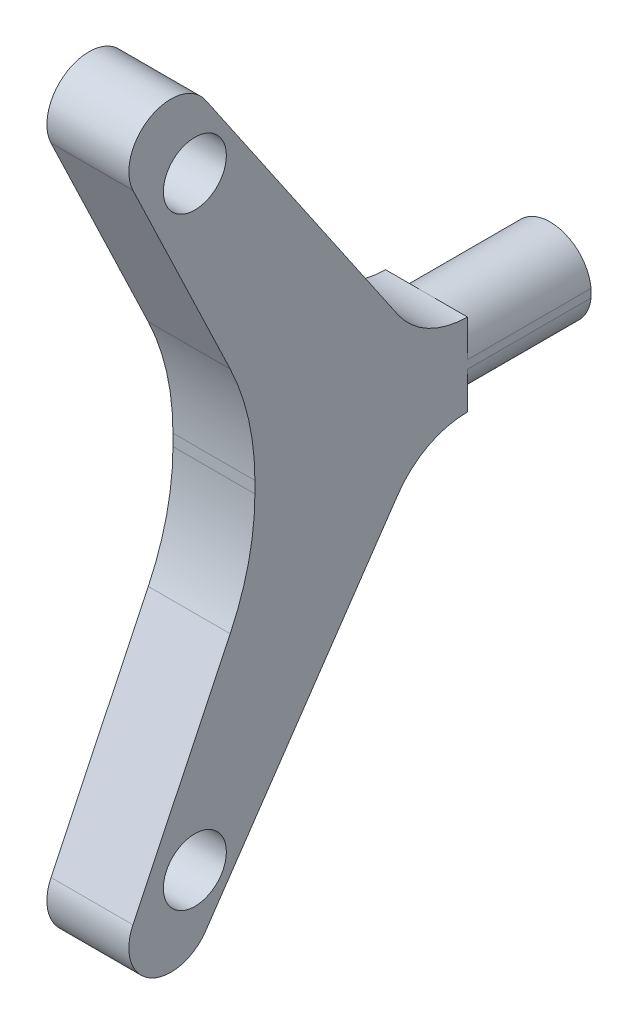
ISO-10303-21;
HEADER;
FILE_DESCRIPTION(('STEP AP214'),'2;1');
FILE_NAME('part.step','',(''),(''),'','','');
FILE_SCHEMA(('AUTOMOTIVE_DESIGN { 1 0 10303 214 1 1 1 1 }'));
ENDSEC;
DATA;
#1=APPLICATION_CONTEXT('core data for automotive mechanical design processes');
#2=APPLICATION_PROTOCOL_DEFINITION('international standard','automotive_design',2000,#1);
#3=PRODUCT_CONTEXT('',#1,'mechanical');
#4=PRODUCT('Part','Part','',(#3));
#5=PRODUCT_RELATED_PRODUCT_CATEGORY('part','',(#4));
#6=PRODUCT_DEFINITION_FORMATION('','',#4);
#7=PRODUCT_DEFINITION_CONTEXT('part definition',#1,'design');
#8=PRODUCT_DEFINITION('design','',#6,#7);
#9=PRODUCT_DEFINITION_SHAPE('','',#8);
#10=(LENGTH_UNIT() NAMED_UNIT(*) SI_UNIT(.MILLI.,.METRE.));
#11=(NAMED_UNIT(*) PLANE_ANGLE_UNIT() SI_UNIT($,.RADIAN.));
#12=(NAMED_UNIT(*) SI_UNIT($,.STERADIAN.) SOLID_ANGLE_UNIT());
#13=UNCERTAINTY_MEASURE_WITH_UNIT(LENGTH_MEASURE(1.E-05),#10,'distance_accuracy_value','');
#14=(GEOMETRIC_REPRESENTATION_CONTEXT(3) GLOBAL_UNCERTAINTY_ASSIGNED_CONTEXT((#13)) GLOBAL_UNIT_ASSIGNED_CONTEXT((#10,
#11,#12)) REPRESENTATION_CONTEXT('',''));
#15=CARTESIAN_POINT('',(0.,0.,0.));
#16=DIRECTION('',(0.,0.,1.));
#17=DIRECTION('',(1.,0.,0.));
#18=AXIS2_PLACEMENT_3D('',#15,#16,#17);
#19=CARTESIAN_POINT('',(4.875,4.9,-40.));
#20=DIRECTION('',(0.,0.,1.));
#21=DIRECTION('',(1.,0.,0.));
#22=AXIS2_PLACEMENT_3D('',#19,#20,#21);
#23=PLANE('',#22);
#24=CARTESIAN_POINT('',(0.,0.,-40.));
#25=DIRECTION('',(0.,0.,-1.));
#26=DIRECTION('',(-1.,0.,0.));
#27=AXIS2_PLACEMENT_3D('',#24,#25,#26);
#28=CIRCLE('',#27,4.9);
#29=CARTESIAN_POINT('',(-4.875,0.494342998332145,-40.));
#30=VERTEX_POINT('',#29);
#31=CARTESIAN_POINT('',(4.875,0.494342998332146,-40.));
#32=VERTEX_POINT('',#31);
#33=EDGE_CURVE('E64',#30,#32,#28,.T.);
#34=ORIENTED_EDGE('',*,*,#33,.T.);
#35=DIRECTION('',(0.,1.,0.));
#36=VECTOR('',#35,1.);
#37=CARTESIAN_POINT('',(4.875,4.9,-40.));
#38=LINE('',#37,#36);
#39=CARTESIAN_POINT('',(4.875,-0.494342998332146,-40.));
#40=VERTEX_POINT('',#39);
#41=EDGE_CURVE('E296',#40,#32,#38,.T.);
#42=ORIENTED_EDGE('',*,*,#41,.F.);
#43=CARTESIAN_POINT('',(-4.875,-0.494342998332146,-40.));
#44=VERTEX_POINT('',#43);
#45=EDGE_CURVE('E341',#40,#44,#28,.T.);
#46=ORIENTED_EDGE('',*,*,#45,.T.);
#47=DIRECTION('',(0.,1.,0.));
#48=VECTOR('',#47,1.);
#49=CARTESIAN_POINT('',(-4.875,4.9,-40.));
#50=LINE('',#49,#48);
#51=EDGE_CURVE('E188',#44,#30,#50,.T.);
#52=ORIENTED_EDGE('',*,*,#51,.T.);
#53=EDGE_LOOP('',(#34,#42,#46,#52));
#54=FACE_BOUND('',#53,.T.);
#55=ADVANCED_FACE('F39',(#54),#23,.F.);
#56=CARTESIAN_POINT('',(4.875,40.,10.));
#57=DIRECTION('',(-1.,0.,0.));
#58=DIRECTION('',(0.,0.,1.));
#59=AXIS2_PLACEMENT_3D('',#56,#57,#58);
#60=PLANE('',#59);
#61=CARTESIAN_POINT('',(4.875,-35.8845811988186,7.14483633710532));
#62=DIRECTION('',(1.,0.,0.));
#63=DIRECTION('',(0.,0.,-1.));
#64=AXIS2_PLACEMENT_3D('',#61,#62,#63);
#65=CIRCLE('',#64,3.75);
#66=CARTESIAN_POINT('',(4.875,-35.8845811988186,3.39483633710531));
#67=VERTEX_POINT('',#66);
#68=EDGE_CURVE('E352',#67,#67,#65,.T.);
#69=ORIENTED_EDGE('',*,*,#68,.F.);
#70=EDGE_LOOP('',(#69));
#71=FACE_BOUND('',#70,.T.);
#72=CARTESIAN_POINT('',(4.875,35.8845811988187,7.14483633710531));
#73=DIRECTION('',(1.,0.,0.));
#74=DIRECTION('',(0.,0.,-1.));
#75=AXIS2_PLACEMENT_3D('',#72,#73,#74);
#76=CIRCLE('',#75,3.75);
#77=CARTESIAN_POINT('',(4.875,35.8845811988187,3.3948363371053));
#78=VERTEX_POINT('',#77);
#79=EDGE_CURVE('E343',#78,#78,#76,.T.);
#80=ORIENTED_EDGE('',*,*,#79,.F.);
#81=EDGE_LOOP('',(#80));
#82=FACE_BOUND('',#81,.T.);
#83=DIRECTION('',(0.,-1.,0.));
#84=VECTOR('',#83,1.);
#85=CARTESIAN_POINT('',(4.875,40.,-25.2831158131346));
#86=LINE('',#85,#84);
#87=CARTESIAN_POINT('',(4.875,4.9,-25.2831158131346));
#88=VERTEX_POINT('',#87);
#89=CARTESIAN_POINT('',(4.875,0.494342998332146,-25.2831158131346));
#90=VERTEX_POINT('',#89);
#91=EDGE_CURVE('E328',#88,#90,#86,.T.);
#92=ORIENTED_EDGE('',*,*,#91,.F.);
#93=CARTESIAN_POINT('',(4.875,14.9,-25.2831158131346));
#94=DIRECTION('',(-1.,0.,0.));
#95=DIRECTION('',(0.,0.,-1.));
#96=AXIS2_PLACEMENT_3D('',#93,#94,#95);
#97=CIRCLE('',#96,10.);
#98=CARTESIAN_POINT('',(4.875,9.2641664066958,-17.022523842302));
#99=VERTEX_POINT('',#98);
#100=EDGE_CURVE('E293',#88,#99,#97,.T.);
#101=ORIENTED_EDGE('',*,*,#100,.T.);
#102=DIRECTION('',(0.,0.826059197083259,0.563583359330421));
#103=VECTOR('',#102,1.);
#104=CARTESIAN_POINT('',(4.875,42.8179167966521,5.8697040145837));
#105=LINE('',#104,#103);
#106=CARTESIAN_POINT('',(4.875,42.8179167966521,5.8697040145837));
#107=VERTEX_POINT('',#106);
#108=EDGE_CURVE('E204',#99,#107,#105,.T.);
#109=ORIENTED_EDGE('',*,*,#108,.T.);
#110=CARTESIAN_POINT('',(4.875,40.,10.));
#111=DIRECTION('',(1.,0.,0.));
#112=DIRECTION('',(0.,0.,1.));
#113=AXIS2_PLACEMENT_3D('',#110,#111,#112);
#114=CIRCLE('',#113,5.);
#115=CARTESIAN_POINT('',(4.875,37.8428514543704,14.5107327732962));
#116=VERTEX_POINT('',#115);
#117=EDGE_CURVE('E193',#107,#116,#114,.T.);
#118=ORIENTED_EDGE('',*,*,#117,.T.);
#119=DIRECTION('',(0.,-0.902146554659234,-0.431429709125918));
#120=VECTOR('',#119,1.);
#121=CARTESIAN_POINT('',(4.875,13.638530567672,2.93560336022303));
#122=LINE('',#121,#120);
#123=CARTESIAN_POINT('',(4.875,13.638530567672,2.93560336022303));
#124=VERTEX_POINT('',#123);
#125=EDGE_CURVE('E322',#116,#124,#122,.T.);
#126=ORIENTED_EDGE('',*,*,#125,.T.);
#127=CARTESIAN_POINT('',(4.875,0.695639293894342,30.));
#128=DIRECTION('',(-1.,0.,0.));
#129=DIRECTION('',(0.,0.,-1.));
#130=AXIS2_PLACEMENT_3D('',#127,#128,#129);
#131=CIRCLE('',#130,30.);
#132=CARTESIAN_POINT('',(4.875,0.695639293894235,0.));
#133=VERTEX_POINT('',#132);
#134=EDGE_CURVE('E319',#124,#133,#131,.T.);
#135=ORIENTED_EDGE('',*,*,#134,.T.);
#136=DIRECTION('',(0.,-1.,0.));
#137=VECTOR('',#136,1.);
#138=CARTESIAN_POINT('',(4.875,-0.695639293894238,0.));
#139=LINE('',#138,#137);
#140=CARTESIAN_POINT('',(4.875,-0.695639293894238,0.));
#141=VERTEX_POINT('',#140);
#142=EDGE_CURVE('E316',#133,#141,#139,.T.);
#143=ORIENTED_EDGE('',*,*,#142,.T.);
#144=CARTESIAN_POINT('',(4.875,-0.695639293894342,30.));
#145=DIRECTION('',(-1.,0.,0.));
#146=DIRECTION('',(0.,0.,-1.));
#147=AXIS2_PLACEMENT_3D('',#144,#145,#146);
#148=CIRCLE('',#147,30.);
#149=CARTESIAN_POINT('',(4.875,-13.638530567672,2.93560336022304));
#150=VERTEX_POINT('',#149);
#151=EDGE_CURVE('E313',#141,#150,#148,.T.);
#152=ORIENTED_EDGE('',*,*,#151,.T.);
#153=DIRECTION('',(0.,-0.902146554659234,0.431429709125918));
#154=VECTOR('',#153,1.);
#155=CARTESIAN_POINT('',(4.875,-13.638530567672,2.93560336022303));
#156=LINE('',#155,#154);
#157=CARTESIAN_POINT('',(4.875,-37.8428514543704,14.5107327732962));
#158=VERTEX_POINT('',#157);
#159=EDGE_CURVE('E310',#150,#158,#156,.T.);
#160=ORIENTED_EDGE('',*,*,#159,.T.);
#161=CARTESIAN_POINT('',(4.875,-40.,10.));
#162=DIRECTION('',(1.,0.,0.));
#163=DIRECTION('',(0.,0.,-1.));
#164=AXIS2_PLACEMENT_3D('',#161,#162,#163);
#165=CIRCLE('',#164,5.);
#166=CARTESIAN_POINT('',(4.875,-42.8179167966521,5.86970401458371));
#167=VERTEX_POINT('',#166);
#168=EDGE_CURVE('E307',#158,#167,#165,.T.);
#169=ORIENTED_EDGE('',*,*,#168,.T.);
#170=DIRECTION('',(0.,0.826059197083259,-0.563583359330421));
#171=VECTOR('',#170,1.);
#172=CARTESIAN_POINT('',(4.875,-42.8179167966521,5.8697040145837));
#173=LINE('',#172,#171);
#174=CARTESIAN_POINT('',(4.875,-9.26416640669579,-17.022523842302));
#175=VERTEX_POINT('',#174);
#176=EDGE_CURVE('E304',#167,#175,#173,.T.);
#177=ORIENTED_EDGE('',*,*,#176,.T.);
#178=CARTESIAN_POINT('',(4.875,-14.9,-25.2831158131346));
#179=DIRECTION('',(-1.,0.,0.));
#180=DIRECTION('',(0.,0.,-1.));
#181=AXIS2_PLACEMENT_3D('',#178,#179,#180);
#182=CIRCLE('',#181,10.);
#183=CARTESIAN_POINT('',(4.875,-4.9,-25.2831158131346));
#184=VERTEX_POINT('',#183);
#185=EDGE_CURVE('E300',#175,#184,#182,.T.);
#186=ORIENTED_EDGE('',*,*,#185,.T.);
#187=CARTESIAN_POINT('',(4.875,-0.494342998332146,-25.2831158131346));
#188=VERTEX_POINT('',#187);
#189=EDGE_CURVE('E290',#188,#184,#86,.T.);
#190=ORIENTED_EDGE('',*,*,#189,.F.);
#191=DIRECTION('',(0.,0.,-1.));
#192=VECTOR('',#191,1.);
#193=CARTESIAN_POINT('',(4.875,-0.494342998332146,-25.2831158131346));
#194=LINE('',#193,#192);
#195=EDGE_CURVE('E175',#40,#188,#194,.F.);
#196=ORIENTED_EDGE('',*,*,#195,.F.);
#197=ORIENTED_EDGE('',*,*,#41,.T.);
#198=DIRECTION('',(0.,0.,-1.));
#199=VECTOR('',#198,1.);
#200=CARTESIAN_POINT('',(4.875,0.494342998332146,-25.2831158131346));
#201=LINE('',#200,#199);
#202=EDGE_CURVE('E335',#90,#32,#201,.T.);
#203=ORIENTED_EDGE('',*,*,#202,.F.);
#204=EDGE_LOOP('',(#92,#101,#109,#118,#126,#135,#143,#152,#160,#169,#177,#186,#190,#196,#197,#203));
#205=FACE_BOUND('',#204,.T.);
#206=ADVANCED_FACE('F370',(#71,#82,#205),#60,.F.);
#207=CARTESIAN_POINT('',(-4.875,40.,10.));
#208=DIRECTION('',(-1.,0.,0.));
#209=DIRECTION('',(0.,0.,1.));
#210=AXIS2_PLACEMENT_3D('',#207,#208,#209);
#211=PLANE('',#210);
#212=CARTESIAN_POINT('',(-4.875,-35.8845811988186,7.14483633710532));
#213=DIRECTION('',(1.,0.,0.));
#214=DIRECTION('',(0.,0.,-1.));
#215=AXIS2_PLACEMENT_3D('',#212,#213,#214);
#216=CIRCLE('',#215,3.75);
#217=CARTESIAN_POINT('',(-4.875,-35.8845811988186,3.39483633710531));
#218=VERTEX_POINT('',#217);
#219=EDGE_CURVE('E348',#218,#218,#216,.T.);
#220=ORIENTED_EDGE('',*,*,#219,.T.);
#221=EDGE_LOOP('',(#220));
#222=FACE_BOUND('',#221,.T.);
#223=CARTESIAN_POINT('',(-4.875,35.8845811988187,7.14483633710531));
#224=DIRECTION('',(1.,0.,0.));
#225=DIRECTION('',(0.,0.,-1.));
#226=AXIS2_PLACEMENT_3D('',#223,#224,#225);
#227=CIRCLE('',#226,3.75);
#228=CARTESIAN_POINT('',(-4.875,35.8845811988187,3.3948363371053));
#229=VERTEX_POINT('',#228);
#230=EDGE_CURVE('E347',#229,#229,#227,.T.);
#231=ORIENTED_EDGE('',*,*,#230,.T.);
#232=EDGE_LOOP('',(#231));
#233=FACE_BOUND('',#232,.T.);
#234=CARTESIAN_POINT('',(-4.875,14.9,-25.2831158131346));
#235=DIRECTION('',(-1.,0.,0.));
#236=DIRECTION('',(0.,0.,-1.));
#237=AXIS2_PLACEMENT_3D('',#234,#235,#236);
#238=CIRCLE('',#237,10.);
#239=CARTESIAN_POINT('',(-4.875,4.9,-25.2831158131346));
#240=VERTEX_POINT('',#239);
#241=CARTESIAN_POINT('',(-4.875,9.2641664066958,-17.022523842302));
#242=VERTEX_POINT('',#241);
#243=EDGE_CURVE('E181',#240,#242,#238,.T.);
#244=ORIENTED_EDGE('',*,*,#243,.F.);
#245=DIRECTION('',(0.,-1.,0.));
#246=VECTOR('',#245,1.);
#247=CARTESIAN_POINT('',(-4.875,40.,-25.2831158131346));
#248=LINE('',#247,#246);
#249=CARTESIAN_POINT('',(-4.875,0.494342998332146,-25.2831158131346));
#250=VERTEX_POINT('',#249);
#251=EDGE_CURVE('E12',#240,#250,#248,.T.);
#252=ORIENTED_EDGE('',*,*,#251,.T.);
#253=DIRECTION('',(0.,0.,-1.));
#254=VECTOR('',#253,1.);
#255=CARTESIAN_POINT('',(-4.875,0.494342998332146,-25.2831158131346));
#256=LINE('',#255,#254);
#257=EDGE_CURVE('E43',#250,#30,#256,.T.);
#258=ORIENTED_EDGE('',*,*,#257,.T.);
#259=ORIENTED_EDGE('',*,*,#51,.F.);
#260=DIRECTION('',(0.,0.,-1.));
#261=VECTOR('',#260,1.);
#262=CARTESIAN_POINT('',(-4.875,-0.494342998332146,-25.2831158131346));
#263=LINE('',#262,#261);
#264=CARTESIAN_POINT('',(-4.875,-0.494342998332146,-25.2831158131346));
#265=VERTEX_POINT('',#264);
#266=EDGE_CURVE('E245',#44,#265,#263,.F.);
#267=ORIENTED_EDGE('',*,*,#266,.T.);
#268=CARTESIAN_POINT('',(-4.875,-4.9,-25.2831158131346));
#269=VERTEX_POINT('',#268);
#270=EDGE_CURVE('E49',#265,#269,#248,.T.);
#271=ORIENTED_EDGE('',*,*,#270,.T.);
#272=CARTESIAN_POINT('',(-4.875,-14.9,-25.2831158131346));
#273=DIRECTION('',(-1.,0.,0.));
#274=DIRECTION('',(0.,0.,-1.));
#275=AXIS2_PLACEMENT_3D('',#272,#273,#274);
#276=CIRCLE('',#275,10.);
#277=CARTESIAN_POINT('',(-4.875,-9.26416640669579,-17.022523842302));
#278=VERTEX_POINT('',#277);
#279=EDGE_CURVE('E195',#278,#269,#276,.T.);
#280=ORIENTED_EDGE('',*,*,#279,.F.);
#281=DIRECTION('',(0.,0.826059197083259,-0.563583359330421));
#282=VECTOR('',#281,1.);
#283=CARTESIAN_POINT('',(-4.875,-42.8179167966521,5.8697040145837));
#284=LINE('',#283,#282);
#285=CARTESIAN_POINT('',(-4.875,-42.8179167966521,5.86970401458371));
#286=VERTEX_POINT('',#285);
#287=EDGE_CURVE('E263',#286,#278,#284,.T.);
#288=ORIENTED_EDGE('',*,*,#287,.F.);
#289=CARTESIAN_POINT('',(-4.875,-40.,10.));
#290=DIRECTION('',(1.,0.,0.));
#291=DIRECTION('',(0.,0.,-1.));
#292=AXIS2_PLACEMENT_3D('',#289,#290,#291);
#293=CIRCLE('',#292,5.);
#294=CARTESIAN_POINT('',(-4.875,-37.8428514543704,14.5107327732962));
#295=VERTEX_POINT('',#294);
#296=EDGE_CURVE('E266',#295,#286,#293,.T.);
#297=ORIENTED_EDGE('',*,*,#296,.F.);
#298=DIRECTION('',(0.,-0.902146554659234,0.431429709125918));
#299=VECTOR('',#298,1.);
#300=CARTESIAN_POINT('',(-4.875,-13.638530567672,2.93560336022303));
#301=LINE('',#300,#299);
#302=CARTESIAN_POINT('',(-4.875,-13.638530567672,2.93560336022304));
#303=VERTEX_POINT('',#302);
#304=EDGE_CURVE('E271',#303,#295,#301,.T.);
#305=ORIENTED_EDGE('',*,*,#304,.F.);
#306=CARTESIAN_POINT('',(-4.875,-0.695639293894342,30.));
#307=DIRECTION('',(-1.,0.,0.));
#308=DIRECTION('',(0.,0.,-1.));
#309=AXIS2_PLACEMENT_3D('',#306,#307,#308);
#310=CIRCLE('',#309,30.);
#311=CARTESIAN_POINT('',(-4.875,-0.695639293894238,0.));
#312=VERTEX_POINT('',#311);
#313=EDGE_CURVE('E274',#312,#303,#310,.T.);
#314=ORIENTED_EDGE('',*,*,#313,.F.);
#315=DIRECTION('',(0.,-1.,0.));
#316=VECTOR('',#315,1.);
#317=CARTESIAN_POINT('',(-4.875,-0.695639293894238,0.));
#318=LINE('',#317,#316);
#319=CARTESIAN_POINT('',(-4.875,0.695639293894235,0.));
#320=VERTEX_POINT('',#319);
#321=EDGE_CURVE('E277',#320,#312,#318,.T.);
#322=ORIENTED_EDGE('',*,*,#321,.F.);
#323=CARTESIAN_POINT('',(-4.875,0.695639293894342,30.));
#324=DIRECTION('',(-1.,0.,0.));
#325=DIRECTION('',(0.,0.,-1.));
#326=AXIS2_PLACEMENT_3D('',#323,#324,#325);
#327=CIRCLE('',#326,30.);
#328=CARTESIAN_POINT('',(-4.875,13.638530567672,2.93560336022303));
#329=VERTEX_POINT('',#328);
#330=EDGE_CURVE('E280',#329,#320,#327,.T.);
#331=ORIENTED_EDGE('',*,*,#330,.F.);
#332=DIRECTION('',(0.,-0.902146554659234,-0.431429709125918));
#333=VECTOR('',#332,1.);
#334=CARTESIAN_POINT('',(-4.875,13.638530567672,2.93560336022303));
#335=LINE('',#334,#333);
#336=CARTESIAN_POINT('',(-4.875,37.8428514543704,14.5107327732962));
#337=VERTEX_POINT('',#336);
#338=EDGE_CURVE('E283',#337,#329,#335,.T.);
#339=ORIENTED_EDGE('',*,*,#338,.F.);
#340=CARTESIAN_POINT('',(-4.875,40.,10.));
#341=DIRECTION('',(1.,0.,0.));
#342=DIRECTION('',(0.,0.,1.));
#343=AXIS2_PLACEMENT_3D('',#340,#341,#342);
#344=CIRCLE('',#343,5.);
#345=CARTESIAN_POINT('',(-4.875,42.8179167966521,5.8697040145837));
#346=VERTEX_POINT('',#345);
#347=EDGE_CURVE('E286',#346,#337,#344,.T.);
#348=ORIENTED_EDGE('',*,*,#347,.F.);
#349=DIRECTION('',(0.,0.826059197083259,0.563583359330421));
#350=VECTOR('',#349,1.);
#351=CARTESIAN_POINT('',(-4.875,42.8179167966521,5.8697040145837));
#352=LINE('',#351,#350);
#353=EDGE_CURVE('E183',#242,#346,#352,.T.);
#354=ORIENTED_EDGE('',*,*,#353,.F.);
#355=EDGE_LOOP('',(#244,#252,#258,#259,#267,#271,#280,#288,#297,#305,#314,#322,#331,#339,#348,#354));
#356=FACE_BOUND('',#355,.T.);
#357=ADVANCED_FACE('F179',(#222,#233,#356),#211,.T.);
#358=CARTESIAN_POINT('',(4.875,40.,10.));
#359=DIRECTION('',(-1.,0.,0.));
#360=DIRECTION('',(0.,0.,1.));
#361=AXIS2_PLACEMENT_3D('',#358,#359,#360);
#362=CYLINDRICAL_SURFACE('',#361,5.);
#363=ORIENTED_EDGE('',*,*,#347,.T.);
#364=DIRECTION('',(-1.,0.,0.));
#365=VECTOR('',#364,1.);
#366=CARTESIAN_POINT('',(4.875,37.8428514543704,14.5107327732962));
#367=LINE('',#366,#365);
#368=EDGE_CURVE('E241',#116,#337,#367,.T.);
#369=ORIENTED_EDGE('',*,*,#368,.F.);
#370=ORIENTED_EDGE('',*,*,#117,.F.);
#371=DIRECTION('',(-1.,0.,0.));
#372=VECTOR('',#371,1.);
#373=CARTESIAN_POINT('',(4.875,42.8179167966521,5.8697040145837));
#374=LINE('',#373,#372);
#375=EDGE_CURVE('E199',#107,#346,#374,.T.);
#376=ORIENTED_EDGE('',*,*,#375,.T.);
#377=EDGE_LOOP('',(#363,#369,#370,#376));
#378=FACE_BOUND('',#377,.T.);
#379=ADVANCED_FACE('F41',(#378),#362,.T.);
#380=CARTESIAN_POINT('',(4.875,13.638530567672,2.93560336022303));
#381=DIRECTION('',(0.,0.431429709125918,-0.902146554659234));
#382=DIRECTION('',(0.,0.902146554659234,0.431429709125918));
#383=AXIS2_PLACEMENT_3D('',#380,#381,#382);
#384=PLANE('',#383);
#385=ORIENTED_EDGE('',*,*,#338,.T.);
#386=DIRECTION('',(-1.,0.,0.));
#387=VECTOR('',#386,1.);
#388=CARTESIAN_POINT('',(4.875,13.638530567672,2.93560336022303));
#389=LINE('',#388,#387);
#390=EDGE_CURVE('E237',#124,#329,#389,.T.);
#391=ORIENTED_EDGE('',*,*,#390,.F.);
#392=ORIENTED_EDGE('',*,*,#125,.F.);
#393=ORIENTED_EDGE('',*,*,#368,.T.);
#394=EDGE_LOOP('',(#385,#391,#392,#393));
#395=FACE_BOUND('',#394,.T.);
#396=ADVANCED_FACE('F390',(#395),#384,.F.);
#397=CARTESIAN_POINT('',(4.875,0.695639293894342,30.));
#398=DIRECTION('',(-1.,0.,0.));
#399=DIRECTION('',(0.,0.,1.));
#400=AXIS2_PLACEMENT_3D('',#397,#398,#399);
#401=CYLINDRICAL_SURFACE('',#400,30.);
#402=ORIENTED_EDGE('',*,*,#330,.T.);
#403=DIRECTION('',(-1.,0.,0.));
#404=VECTOR('',#403,1.);
#405=CARTESIAN_POINT('',(4.875,0.695639293894235,0.));
#406=LINE('',#405,#404);
#407=EDGE_CURVE('E233',#133,#320,#406,.T.);
#408=ORIENTED_EDGE('',*,*,#407,.F.);
#409=ORIENTED_EDGE('',*,*,#134,.F.);
#410=ORIENTED_EDGE('',*,*,#390,.T.);
#411=EDGE_LOOP('',(#402,#408,#409,#410));
#412=FACE_BOUND('',#411,.T.);
#413=ADVANCED_FACE('F395',(#412),#401,.F.);
#414=CARTESIAN_POINT('',(4.875,-0.695639293894238,0.));
#415=DIRECTION('',(0.,0.,-1.));
#416=DIRECTION('',(-1.,0.,0.));
#417=AXIS2_PLACEMENT_3D('',#414,#415,#416);
#418=PLANE('',#417);
#419=ORIENTED_EDGE('',*,*,#321,.T.);
#420=DIRECTION('',(-1.,0.,0.));
#421=VECTOR('',#420,1.);
#422=CARTESIAN_POINT('',(4.875,-0.695639293894238,0.));
#423=LINE('',#422,#421);
#424=EDGE_CURVE('E229',#141,#312,#423,.T.);
#425=ORIENTED_EDGE('',*,*,#424,.F.);
#426=ORIENTED_EDGE('',*,*,#142,.F.);
#427=ORIENTED_EDGE('',*,*,#407,.T.);
#428=EDGE_LOOP('',(#419,#425,#426,#427));
#429=FACE_BOUND('',#428,.T.);
#430=ADVANCED_FACE('F401',(#429),#418,.F.);
#431=CARTESIAN_POINT('',(4.875,-0.695639293894342,30.));
#432=DIRECTION('',(-1.,0.,0.));
#433=DIRECTION('',(0.,0.,1.));
#434=AXIS2_PLACEMENT_3D('',#431,#432,#433);
#435=CYLINDRICAL_SURFACE('',#434,30.);
#436=ORIENTED_EDGE('',*,*,#313,.T.);
#437=DIRECTION('',(-1.,0.,0.));
#438=VECTOR('',#437,1.);
#439=CARTESIAN_POINT('',(4.875,-13.638530567672,2.93560336022304));
#440=LINE('',#439,#438);
#441=EDGE_CURVE('E225',#150,#303,#440,.T.);
#442=ORIENTED_EDGE('',*,*,#441,.F.);
#443=ORIENTED_EDGE('',*,*,#151,.F.);
#444=ORIENTED_EDGE('',*,*,#424,.T.);
#445=EDGE_LOOP('',(#436,#442,#443,#444));
#446=FACE_BOUND('',#445,.T.);
#447=ADVANCED_FACE('F405',(#446),#435,.F.);
#448=CARTESIAN_POINT('',(4.875,-13.638530567672,2.93560336022303));
#449=DIRECTION('',(0.,-0.431429709125918,-0.902146554659234));
#450=DIRECTION('',(0.,0.902146554659234,-0.431429709125918));
#451=AXIS2_PLACEMENT_3D('',#448,#449,#450);
#452=PLANE('',#451);
#453=ORIENTED_EDGE('',*,*,#304,.T.);
#454=DIRECTION('',(-1.,0.,0.));
#455=VECTOR('',#454,1.);
#456=CARTESIAN_POINT('',(4.875,-37.8428514543704,14.5107327732962));
#457=LINE('',#456,#455);
#458=EDGE_CURVE('E221',#158,#295,#457,.T.);
#459=ORIENTED_EDGE('',*,*,#458,.F.);
#460=ORIENTED_EDGE('',*,*,#159,.F.);
#461=ORIENTED_EDGE('',*,*,#441,.T.);
#462=EDGE_LOOP('',(#453,#459,#460,#461));
#463=FACE_BOUND('',#462,.T.);
#464=ADVANCED_FACE('F410',(#463),#452,.F.);
#465=CARTESIAN_POINT('',(4.875,-40.,10.));
#466=DIRECTION('',(-1.,0.,0.));
#467=DIRECTION('',(0.,0.,1.));
#468=AXIS2_PLACEMENT_3D('',#465,#466,#467);
#469=CYLINDRICAL_SURFACE('',#468,5.);
#470=ORIENTED_EDGE('',*,*,#296,.T.);
#471=DIRECTION('',(-1.,0.,0.));
#472=VECTOR('',#471,1.);
#473=CARTESIAN_POINT('',(4.875,-42.8179167966521,5.86970401458371));
#474=LINE('',#473,#472);
#475=EDGE_CURVE('E217',#167,#286,#474,.T.);
#476=ORIENTED_EDGE('',*,*,#475,.F.);
#477=ORIENTED_EDGE('',*,*,#168,.F.);
#478=ORIENTED_EDGE('',*,*,#458,.T.);
#479=EDGE_LOOP('',(#470,#476,#477,#478));
#480=FACE_BOUND('',#479,.T.);
#481=ADVANCED_FACE('F415',(#480),#469,.T.);
#482=CARTESIAN_POINT('',(4.875,-42.8179167966521,5.8697040145837));
#483=DIRECTION('',(0.,0.563583359330421,0.826059197083259));
#484=DIRECTION('',(0.,-0.826059197083259,0.563583359330421));
#485=AXIS2_PLACEMENT_3D('',#482,#483,#484);
#486=PLANE('',#485);
#487=ORIENTED_EDGE('',*,*,#287,.T.);
#488=DIRECTION('',(-1.,0.,0.));
#489=VECTOR('',#488,1.);
#490=CARTESIAN_POINT('',(4.875,-9.26416640669579,-17.022523842302));
#491=LINE('',#490,#489);
#492=EDGE_CURVE('E213',#175,#278,#491,.T.);
#493=ORIENTED_EDGE('',*,*,#492,.F.);
#494=ORIENTED_EDGE('',*,*,#176,.F.);
#495=ORIENTED_EDGE('',*,*,#475,.T.);
#496=EDGE_LOOP('',(#487,#493,#494,#495));
#497=FACE_BOUND('',#496,.T.);
#498=ADVANCED_FACE('F418',(#497),#486,.F.);
#499=CARTESIAN_POINT('',(4.875,-14.9,-25.2831158131346));
#500=DIRECTION('',(-1.,0.,0.));
#501=DIRECTION('',(0.,0.,1.));
#502=AXIS2_PLACEMENT_3D('',#499,#500,#501);
#503=CYLINDRICAL_SURFACE('',#502,10.);
#504=ORIENTED_EDGE('',*,*,#279,.T.);
#505=DIRECTION('',(-1.,0.,0.));
#506=VECTOR('',#505,1.);
#507=CARTESIAN_POINT('',(4.875,-4.9,-25.2831158131346));
#508=LINE('',#507,#506);
#509=CARTESIAN_POINT('',(0.,-4.9,-25.2831158131346));
#510=VERTEX_POINT('',#509);
#511=EDGE_CURVE('E259',#510,#269,#508,.T.);
#512=ORIENTED_EDGE('',*,*,#511,.F.);
#513=DIRECTION('',(-1.,0.,0.));
#514=VECTOR('',#513,1.);
#515=CARTESIAN_POINT('',(4.875,-4.9,-25.2831158131346));
#516=LINE('',#515,#514);
#517=EDGE_CURVE('E210',#184,#510,#516,.T.);
#518=ORIENTED_EDGE('',*,*,#517,.F.);
#519=ORIENTED_EDGE('',*,*,#185,.F.);
#520=ORIENTED_EDGE('',*,*,#492,.T.);
#521=EDGE_LOOP('',(#504,#512,#518,#519,#520));
#522=FACE_BOUND('',#521,.T.);
#523=ADVANCED_FACE('F257',(#522),#503,.F.);
#524=CARTESIAN_POINT('',(4.875,14.9,-25.2831158131346));
#525=DIRECTION('',(-1.,0.,0.));
#526=DIRECTION('',(0.,0.,1.));
#527=AXIS2_PLACEMENT_3D('',#524,#525,#526);
#528=CYLINDRICAL_SURFACE('',#527,10.);
#529=ORIENTED_EDGE('',*,*,#243,.T.);
#530=DIRECTION('',(-1.,0.,0.));
#531=VECTOR('',#530,1.);
#532=CARTESIAN_POINT('',(4.875,9.2641664066958,-17.022523842302));
#533=LINE('',#532,#531);
#534=EDGE_CURVE('E203',#99,#242,#533,.T.);
#535=ORIENTED_EDGE('',*,*,#534,.F.);
#536=ORIENTED_EDGE('',*,*,#100,.F.);
#537=DIRECTION('',(-1.,0.,0.));
#538=VECTOR('',#537,1.);
#539=CARTESIAN_POINT('',(4.875,4.9,-25.2831158131346));
#540=LINE('',#539,#538);
#541=CARTESIAN_POINT('',(0.,4.9,-25.2831158131346));
#542=VERTEX_POINT('',#541);
#543=EDGE_CURVE('E207',#88,#542,#540,.T.);
#544=ORIENTED_EDGE('',*,*,#543,.T.);
#545=DIRECTION('',(-1.,0.,0.));
#546=VECTOR('',#545,1.);
#547=CARTESIAN_POINT('',(4.875,4.9,-25.2831158131346));
#548=LINE('',#547,#546);
#549=EDGE_CURVE('E172',#240,#542,#548,.F.);
#550=ORIENTED_EDGE('',*,*,#549,.F.);
#551=EDGE_LOOP('',(#529,#535,#536,#544,#550));
#552=FACE_BOUND('',#551,.T.);
#553=ADVANCED_FACE('F380',(#552),#528,.F.);
#554=CARTESIAN_POINT('',(4.875,42.8179167966521,5.8697040145837));
#555=DIRECTION('',(0.,-0.563583359330421,0.826059197083259));
#556=DIRECTION('',(0.,-0.826059197083259,-0.563583359330421));
#557=AXIS2_PLACEMENT_3D('',#554,#555,#556);
#558=PLANE('',#557);
#559=ORIENTED_EDGE('',*,*,#353,.T.);
#560=ORIENTED_EDGE('',*,*,#375,.F.);
#561=ORIENTED_EDGE('',*,*,#108,.F.);
#562=ORIENTED_EDGE('',*,*,#534,.T.);
#563=EDGE_LOOP('',(#559,#560,#561,#562));
#564=FACE_BOUND('',#563,.T.);
#565=ADVANCED_FACE('F384',(#564),#558,.F.);
#566=CARTESIAN_POINT('',(0.,0.,-25.2831158131346));
#567=DIRECTION('',(0.,0.,-1.));
#568=DIRECTION('',(-1.,0.,0.));
#569=AXIS2_PLACEMENT_3D('',#566,#567,#568);
#570=PLANE('',#569);
#571=ORIENTED_EDGE('',*,*,#511,.T.);
#572=ORIENTED_EDGE('',*,*,#270,.F.);
#573=CARTESIAN_POINT('',(0.,0.,-25.2831158131346));
#574=DIRECTION('',(0.,0.,-1.));
#575=DIRECTION('',(-1.,0.,0.));
#576=AXIS2_PLACEMENT_3D('',#573,#574,#575);
#577=CIRCLE('',#576,4.9);
#578=EDGE_CURVE('E56',#510,#265,#577,.T.);
#579=ORIENTED_EDGE('',*,*,#578,.F.);
#580=EDGE_LOOP('',(#571,#572,#579));
#581=FACE_BOUND('',#580,.T.);
#582=ADVANCED_FACE('F449',(#581),#570,.T.);
#583=CARTESIAN_POINT('',(0.,0.,-25.2831158131346));
#584=DIRECTION('',(0.,0.,-1.));
#585=DIRECTION('',(-1.,0.,0.));
#586=AXIS2_PLACEMENT_3D('',#583,#584,#585);
#587=CYLINDRICAL_SURFACE('',#586,4.9);
#588=EDGE_CURVE('E436',#188,#510,#577,.T.);
#589=ORIENTED_EDGE('',*,*,#588,.T.);
#590=ORIENTED_EDGE('',*,*,#578,.T.);
#591=ORIENTED_EDGE('',*,*,#266,.F.);
#592=ORIENTED_EDGE('',*,*,#45,.F.);
#593=ORIENTED_EDGE('',*,*,#195,.T.);
#594=EDGE_LOOP('',(#589,#590,#591,#592,#593));
#595=FACE_BOUND('',#594,.T.);
#596=ADVANCED_FACE('F446',(#595),#587,.T.);
#597=ORIENTED_EDGE('',*,*,#189,.T.);
#598=ORIENTED_EDGE('',*,*,#517,.T.);
#599=ORIENTED_EDGE('',*,*,#588,.F.);
#600=EDGE_LOOP('',(#597,#598,#599));
#601=FACE_BOUND('',#600,.T.);
#602=ADVANCED_FACE('F448',(#601),#570,.T.);
#603=ORIENTED_EDGE('',*,*,#91,.T.);
#604=EDGE_CURVE('E176',#542,#90,#577,.T.);
#605=ORIENTED_EDGE('',*,*,#604,.F.);
#606=ORIENTED_EDGE('',*,*,#543,.F.);
#607=EDGE_LOOP('',(#603,#605,#606));
#608=FACE_BOUND('',#607,.T.);
#609=ADVANCED_FACE('F455',(#608),#570,.T.);
#610=ORIENTED_EDGE('',*,*,#549,.T.);
#611=EDGE_CURVE('E163',#250,#542,#577,.T.);
#612=ORIENTED_EDGE('',*,*,#611,.F.);
#613=ORIENTED_EDGE('',*,*,#251,.F.);
#614=EDGE_LOOP('',(#610,#612,#613));
#615=FACE_BOUND('',#614,.T.);
#616=ADVANCED_FACE('F170',(#615),#570,.T.);
#617=ORIENTED_EDGE('',*,*,#611,.T.);
#618=ORIENTED_EDGE('',*,*,#604,.T.);
#619=ORIENTED_EDGE('',*,*,#202,.T.);
#620=ORIENTED_EDGE('',*,*,#33,.F.);
#621=ORIENTED_EDGE('',*,*,#257,.F.);
#622=EDGE_LOOP('',(#617,#618,#619,#620,#621));
#623=FACE_BOUND('',#622,.T.);
#624=ADVANCED_FACE('F161',(#623),#587,.T.);
#625=CARTESIAN_POINT('',(-4.875,35.8845811988187,7.14483633710531));
#626=DIRECTION('',(1.,0.,0.));
#627=DIRECTION('',(0.,0.,-1.));
#628=AXIS2_PLACEMENT_3D('',#625,#626,#627);
#629=CYLINDRICAL_SURFACE('',#628,3.75);
#630=ORIENTED_EDGE('',*,*,#230,.F.);
#631=EDGE_LOOP('',(#630));
#632=FACE_BOUND('',#631,.T.);
#633=ORIENTED_EDGE('',*,*,#79,.T.);
#634=EDGE_LOOP('',(#633));
#635=FACE_BOUND('',#634,.T.);
#636=ADVANCED_FACE('F366',(#632,#635),#629,.F.);
#637=CARTESIAN_POINT('',(-4.875,-35.8845811988186,7.14483633710532));
#638=DIRECTION('',(1.,0.,0.));
#639=DIRECTION('',(0.,0.,-1.));
#640=AXIS2_PLACEMENT_3D('',#637,#638,#639);
#641=CYLINDRICAL_SURFACE('',#640,3.75);
#642=ORIENTED_EDGE('',*,*,#219,.F.);
#643=EDGE_LOOP('',(#642));
#644=FACE_BOUND('',#643,.T.);
#645=ORIENTED_EDGE('',*,*,#68,.T.);
#646=EDGE_LOOP('',(#645));
#647=FACE_BOUND('',#646,.T.);
#648=ADVANCED_FACE('F363',(#644,#647),#641,.F.);
#649=CLOSED_SHELL('',(#55,#206,#357,#379,#396,#413,#430,#447,#464,#481,#498,#523,#553,#565,#582,
#596,#602,#609,#616,#624,#636,#648));
#650=MANIFOLD_SOLID_BREP('B2',#649);
#651=ADVANCED_BREP_SHAPE_REPRESENTATION('',(#18,#650),#14);
#652=SHAPE_DEFINITION_REPRESENTATION(#9,#651);
ENDSEC;
END-ISO-10303-21;
